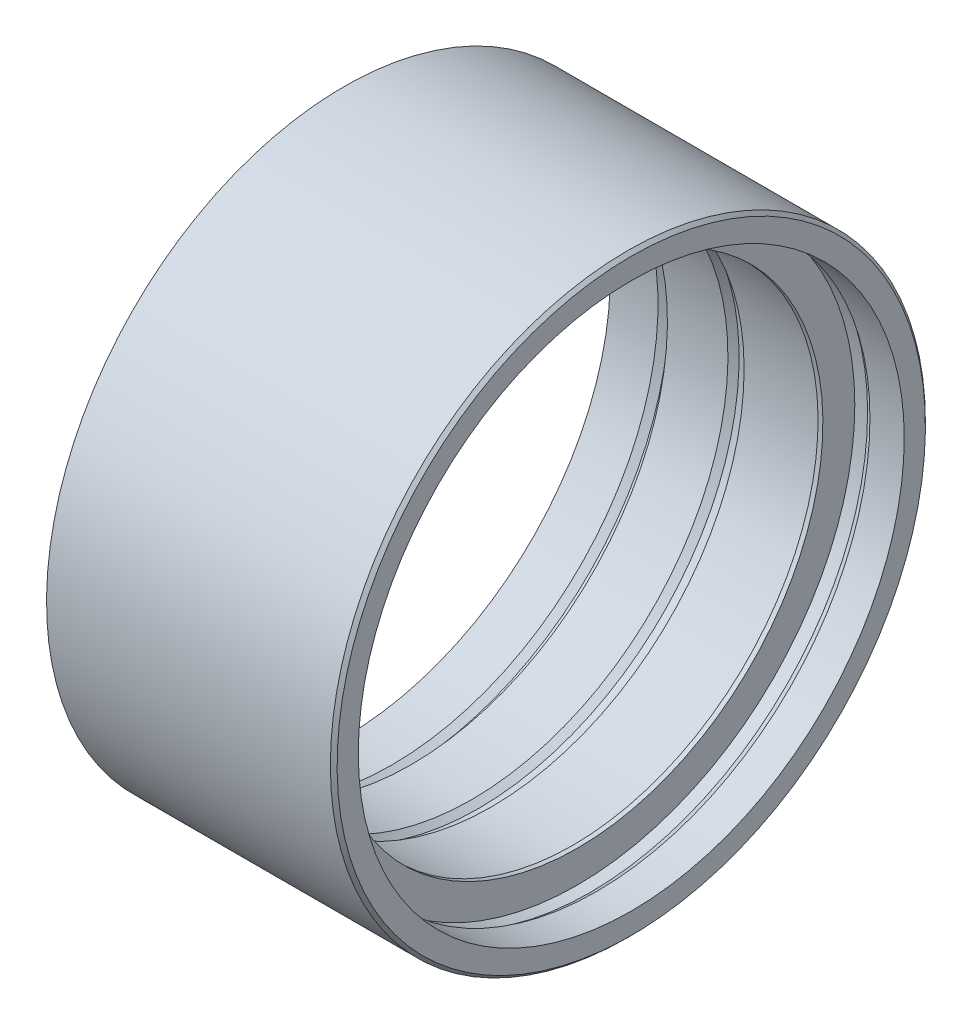
ISO-10303-21;
HEADER;
FILE_DESCRIPTION(('STEP AP214'),'2;1');
FILE_NAME('part.step','',(''),(''),'','','');
FILE_SCHEMA(('AUTOMOTIVE_DESIGN { 1 0 10303 214 1 1 1 1 }'));
ENDSEC;
DATA;
#1=APPLICATION_CONTEXT('core data for automotive mechanical design processes');
#2=APPLICATION_PROTOCOL_DEFINITION('international standard','automotive_design',2000,#1);
#3=PRODUCT_CONTEXT('',#1,'mechanical');
#4=PRODUCT('Part','Part','',(#3));
#5=PRODUCT_RELATED_PRODUCT_CATEGORY('part','',(#4));
#6=PRODUCT_DEFINITION_FORMATION('','',#4);
#7=PRODUCT_DEFINITION_CONTEXT('part definition',#1,'design');
#8=PRODUCT_DEFINITION('design','',#6,#7);
#9=PRODUCT_DEFINITION_SHAPE('','',#8);
#10=(LENGTH_UNIT() NAMED_UNIT(*) SI_UNIT(.MILLI.,.METRE.));
#11=(NAMED_UNIT(*) PLANE_ANGLE_UNIT() SI_UNIT($,.RADIAN.));
#12=(NAMED_UNIT(*) SI_UNIT($,.STERADIAN.) SOLID_ANGLE_UNIT());
#13=UNCERTAINTY_MEASURE_WITH_UNIT(LENGTH_MEASURE(1.E-05),#10,'distance_accuracy_value','');
#14=(GEOMETRIC_REPRESENTATION_CONTEXT(3) GLOBAL_UNCERTAINTY_ASSIGNED_CONTEXT((#13)) GLOBAL_UNIT_ASSIGNED_CONTEXT((#10,
#11,#12)) REPRESENTATION_CONTEXT('',''));
#15=CARTESIAN_POINT('',(0.,0.,0.));
#16=DIRECTION('',(0.,0.,1.));
#17=DIRECTION('',(1.,0.,0.));
#18=AXIS2_PLACEMENT_3D('',#15,#16,#17);
#19=CARTESIAN_POINT('',(6.00000000000056,-44.2500000000002,0.));
#20=DIRECTION('',(1.00000000000002,0.,0.));
#21=DIRECTION('',(0.,1.00000000000004,0.));
#22=AXIS2_PLACEMENT_3D('',#19,#20,#21);
#23=PLANE('',#22);
#24=CARTESIAN_POINT('',(6.00000000000006,-1.11022302462516E-13,-1.2630913280694E-13));
#25=DIRECTION('',(1.00000000000002,0.,0.));
#26=DIRECTION('',(0.,1.00000000000004,0.));
#27=AXIS2_PLACEMENT_3D('',#24,#25,#26);
#28=CIRCLE('',#27,43.75);
#29=CARTESIAN_POINT('',(5.99999999999911,43.7500000000015,0.));
#30=VERTEX_POINT('',#29);
#31=EDGE_CURVE('E12',#30,#30,#28,.T.);
#32=ORIENTED_EDGE('',*,*,#31,.T.);
#33=EDGE_LOOP('',(#32));
#34=FACE_BOUND('',#33,.T.);
#35=CARTESIAN_POINT('',(6.00000000000006,-1.11022302462516E-13,-1.2630913280694E-13));
#36=DIRECTION('',(-1.00000000000002,0.,0.));
#37=DIRECTION('',(0.,-1.00000000000004,0.));
#38=AXIS2_PLACEMENT_3D('',#35,#36,#37);
#39=CIRCLE('',#38,40.6);
#40=CARTESIAN_POINT('',(6.00000000000095,-40.6000000000016,-1.66745847861195E-13));
#41=VERTEX_POINT('',#40);
#42=EDGE_CURVE('E64',#41,#41,#39,.T.);
#43=ORIENTED_EDGE('',*,*,#42,.T.);
#44=EDGE_LOOP('',(#43));
#45=FACE_BOUND('',#44,.T.);
#46=ADVANCED_FACE('F53',(#34,#45),#23,.T.);
#47=CARTESIAN_POINT('',(0.,0.,0.));
#48=DIRECTION('',(-1.00000000000002,0.,0.));
#49=DIRECTION('',(0.,-1.00000000000004,0.));
#50=AXIS2_PLACEMENT_3D('',#47,#48,#49);
#51=CYLINDRICAL_SURFACE('',#50,40.6);
#52=CARTESIAN_POINT('',(0.899999999999956,0.,0.));
#53=DIRECTION('',(-1.00000000000002,0.,0.));
#54=DIRECTION('',(0.,-1.00000000000004,0.));
#55=AXIS2_PLACEMENT_3D('',#52,#53,#54);
#56=CIRCLE('',#55,40.6);
#57=CARTESIAN_POINT('',(0.90000000000084,-40.6000000000016,0.));
#58=VERTEX_POINT('',#57);
#59=EDGE_CURVE('E68',#58,#58,#56,.T.);
#60=ORIENTED_EDGE('',*,*,#59,.T.);
#61=EDGE_LOOP('',(#60));
#62=FACE_BOUND('',#61,.T.);
#63=ORIENTED_EDGE('',*,*,#42,.F.);
#64=EDGE_LOOP('',(#63));
#65=FACE_BOUND('',#64,.T.);
#66=ADVANCED_FACE('F133',(#62,#65),#51,.F.);
#67=CARTESIAN_POINT('',(0.899999999999956,0.,0.));
#68=DIRECTION('',(-1.00000000000002,0.,0.));
#69=DIRECTION('',(0.,-1.00000000000004,0.));
#70=AXIS2_PLACEMENT_3D('',#67,#68,#69);
#71=CONICAL_SURFACE('',#70,40.6,0.576375220591183);
#72=CARTESIAN_POINT('',(-0.0999999999999335,0.,0.));
#73=DIRECTION('',(-1.00000000000002,0.,0.));
#74=DIRECTION('',(0.,-1.00000000000004,0.));
#75=AXIS2_PLACEMENT_3D('',#72,#73,#74);
#76=CIRCLE('',#75,41.25);
#77=CARTESIAN_POINT('',(-0.0999999999990359,-41.2500000000016,0.));
#78=VERTEX_POINT('',#77);
#79=EDGE_CURVE('E73',#78,#78,#76,.T.);
#80=ORIENTED_EDGE('',*,*,#79,.T.);
#81=EDGE_LOOP('',(#80));
#82=FACE_BOUND('',#81,.T.);
#83=ORIENTED_EDGE('',*,*,#59,.F.);
#84=EDGE_LOOP('',(#83));
#85=FACE_BOUND('',#84,.T.);
#86=ADVANCED_FACE('F137',(#82,#85),#71,.F.);
#87=CARTESIAN_POINT('',(0.,0.,0.));
#88=DIRECTION('',(-1.00000000000002,0.,0.));
#89=DIRECTION('',(0.,-1.00000000000004,0.));
#90=AXIS2_PLACEMENT_3D('',#87,#88,#89);
#91=CYLINDRICAL_SURFACE('',#90,41.25);
#92=CARTESIAN_POINT('',(-1.99999999999995,0.,0.));
#93=DIRECTION('',(-1.00000000000002,0.,0.));
#94=DIRECTION('',(0.,-1.00000000000004,0.));
#95=AXIS2_PLACEMENT_3D('',#92,#93,#94);
#96=CIRCLE('',#95,41.25);
#97=CARTESIAN_POINT('',(-1.99999999999905,-41.2500000000016,0.));
#98=VERTEX_POINT('',#97);
#99=EDGE_CURVE('E76',#98,#98,#96,.T.);
#100=ORIENTED_EDGE('',*,*,#99,.T.);
#101=EDGE_LOOP('',(#100));
#102=FACE_BOUND('',#101,.T.);
#103=ORIENTED_EDGE('',*,*,#79,.F.);
#104=EDGE_LOOP('',(#103));
#105=FACE_BOUND('',#104,.T.);
#106=ADVANCED_FACE('F144',(#102,#105),#91,.F.);
#107=CARTESIAN_POINT('',(-2.,-36.5,0.));
#108=DIRECTION('',(1.00000000000002,0.,0.));
#109=DIRECTION('',(0.,1.00000000000004,0.));
#110=AXIS2_PLACEMENT_3D('',#107,#108,#109);
#111=PLANE('',#110);
#112=CARTESIAN_POINT('',(-1.99999999999995,0.,0.));
#113=DIRECTION('',(-1.00000000000002,0.,0.));
#114=DIRECTION('',(0.,-1.00000000000004,0.));
#115=AXIS2_PLACEMENT_3D('',#112,#113,#114);
#116=CIRCLE('',#115,36.5);
#117=CARTESIAN_POINT('',(-1.99999999999915,-36.5000000000014,0.));
#118=VERTEX_POINT('',#117);
#119=EDGE_CURVE('E79',#118,#118,#116,.T.);
#120=ORIENTED_EDGE('',*,*,#119,.T.);
#121=EDGE_LOOP('',(#120));
#122=FACE_BOUND('',#121,.T.);
#123=ORIENTED_EDGE('',*,*,#99,.F.);
#124=EDGE_LOOP('',(#123));
#125=FACE_BOUND('',#124,.T.);
#126=ADVANCED_FACE('F148',(#122,#125),#111,.T.);
#127=CARTESIAN_POINT('',(0.,0.,0.));
#128=DIRECTION('',(-1.00000000000002,0.,0.));
#129=DIRECTION('',(0.,-1.00000000000004,0.));
#130=AXIS2_PLACEMENT_3D('',#127,#128,#129);
#131=CYLINDRICAL_SURFACE('',#130,36.5);
#132=CARTESIAN_POINT('',(-2.71667511527912,0.,0.));
#133=DIRECTION('',(-1.00000000000002,0.,0.));
#134=DIRECTION('',(0.,-1.00000000000004,0.));
#135=AXIS2_PLACEMENT_3D('',#132,#133,#134);
#136=CIRCLE('',#135,36.5);
#137=CARTESIAN_POINT('',(-2.71667511527833,-36.5000000000014,0.));
#138=VERTEX_POINT('',#137);
#139=EDGE_CURVE('E82',#138,#138,#136,.T.);
#140=ORIENTED_EDGE('',*,*,#139,.T.);
#141=EDGE_LOOP('',(#140));
#142=FACE_BOUND('',#141,.T.);
#143=ORIENTED_EDGE('',*,*,#119,.F.);
#144=EDGE_LOOP('',(#143));
#145=FACE_BOUND('',#144,.T.);
#146=ADVANCED_FACE('F152',(#142,#145),#131,.F.);
#147=CARTESIAN_POINT('',(-2.71667511527912,0.,0.));
#148=DIRECTION('',(-1.00000000000002,0.,0.));
#149=DIRECTION('',(0.,-1.00000000000004,0.));
#150=AXIS2_PLACEMENT_3D('',#147,#148,#149);
#151=CONICAL_SURFACE('',#150,36.5,1.41992030538991);
#152=CARTESIAN_POINT('',(-2.8839096216326,0.,0.));
#153=DIRECTION('',(-1.00000000000002,0.,0.));
#154=DIRECTION('',(0.,-1.00000000000004,0.));
#155=AXIS2_PLACEMENT_3D('',#152,#153,#154);
#156=CIRCLE('',#155,37.6000000080923);
#157=CARTESIAN_POINT('',(-2.88390962163178,-37.6000000080937,0.));
#158=VERTEX_POINT('',#157);
#159=EDGE_CURVE('E85',#158,#158,#156,.T.);
#160=ORIENTED_EDGE('',*,*,#159,.T.);
#161=EDGE_LOOP('',(#160));
#162=FACE_BOUND('',#161,.T.);
#163=ORIENTED_EDGE('',*,*,#139,.F.);
#164=EDGE_LOOP('',(#163));
#165=FACE_BOUND('',#164,.T.);
#166=ADVANCED_FACE('F156',(#162,#165),#151,.F.);
#167=CARTESIAN_POINT('',(0.,0.,0.));
#168=DIRECTION('',(-1.00000000000002,0.,0.));
#169=DIRECTION('',(0.,-1.00000000000004,0.));
#170=AXIS2_PLACEMENT_3D('',#167,#168,#169);
#171=CYLINDRICAL_SURFACE('',#170,37.6000000080923);
#172=CARTESIAN_POINT('',(-14.8133409365376,2.77555756156289E-13,-4.26732650794096E-13));
#173=DIRECTION('',(-1.00000000000002,0.,0.));
#174=DIRECTION('',(0.,-1.00000000000004,0.));
#175=AXIS2_PLACEMENT_3D('',#172,#173,#174);
#176=CIRCLE('',#175,37.6000000080923);
#177=CARTESIAN_POINT('',(-14.8133409365368,-37.6000000080935,-4.64181431246491E-13));
#178=VERTEX_POINT('',#177);
#179=EDGE_CURVE('E88',#178,#178,#176,.T.);
#180=ORIENTED_EDGE('',*,*,#179,.T.);
#181=EDGE_LOOP('',(#180));
#182=FACE_BOUND('',#181,.T.);
#183=ORIENTED_EDGE('',*,*,#159,.F.);
#184=EDGE_LOOP('',(#183));
#185=FACE_BOUND('',#184,.T.);
#186=ADVANCED_FACE('F160',(#182,#185),#171,.F.);
#187=CARTESIAN_POINT('',(-14.8133409365368,-37.6000000080924,-2.25383560871781E-13));
#188=DIRECTION('',(-1.00000000000002,0.,0.));
#189=DIRECTION('',(0.,-1.00000000000004,0.));
#190=AXIS2_PLACEMENT_3D('',#187,#188,#189);
#191=PLANE('',#190);
#192=CARTESIAN_POINT('',(-14.8133409365376,2.77555756156289E-13,-4.26732650794096E-13));
#193=DIRECTION('',(-1.00000000000002,0.,0.));
#194=DIRECTION('',(0.,-1.00000000000004,0.));
#195=AXIS2_PLACEMENT_3D('',#192,#193,#194);
#196=CIRCLE('',#195,38.75);
#197=CARTESIAN_POINT('',(-14.8133409365368,-38.7500000000012,-4.65326806172234E-13));
#198=VERTEX_POINT('',#197);
#199=EDGE_CURVE('E91',#198,#198,#196,.T.);
#200=ORIENTED_EDGE('',*,*,#199,.T.);
#201=EDGE_LOOP('',(#200));
#202=FACE_BOUND('',#201,.T.);
#203=ORIENTED_EDGE('',*,*,#179,.F.);
#204=EDGE_LOOP('',(#203));
#205=FACE_BOUND('',#204,.T.);
#206=ADVANCED_FACE('F164',(#202,#205),#191,.T.);
#207=CARTESIAN_POINT('',(0.,0.,0.));
#208=DIRECTION('',(-1.00000000000002,0.,0.));
#209=DIRECTION('',(0.,-1.00000000000004,0.));
#210=AXIS2_PLACEMENT_3D('',#207,#208,#209);
#211=CYLINDRICAL_SURFACE('',#210,38.75);
#212=CARTESIAN_POINT('',(-16.7133409365369,0.,0.));
#213=DIRECTION('',(-1.00000000000002,0.,0.));
#214=DIRECTION('',(0.,-1.00000000000004,0.));
#215=AXIS2_PLACEMENT_3D('',#212,#213,#214);
#216=CIRCLE('',#215,38.75);
#217=CARTESIAN_POINT('',(-16.713340936536,-38.7500000000014,0.));
#218=VERTEX_POINT('',#217);
#219=EDGE_CURVE('E94',#218,#218,#216,.T.);
#220=ORIENTED_EDGE('',*,*,#219,.T.);
#221=EDGE_LOOP('',(#220));
#222=FACE_BOUND('',#221,.T.);
#223=ORIENTED_EDGE('',*,*,#199,.F.);
#224=EDGE_LOOP('',(#223));
#225=FACE_BOUND('',#224,.T.);
#226=ADVANCED_FACE('F168',(#222,#225),#211,.F.);
#227=CARTESIAN_POINT('',(-16.7133409365369,0.,0.));
#228=DIRECTION('',(1.00000000000002,0.,0.));
#229=DIRECTION('',(0.,1.00000000000004,0.));
#230=AXIS2_PLACEMENT_3D('',#227,#228,#229);
#231=CONICAL_SURFACE('',#230,38.75,0.580581589500935);
#232=CARTESIAN_POINT('',(-17.7133409365371,2.08166817117217E-13,-2.87273735489924E-13));
#233=DIRECTION('',(-1.00000000000002,0.,0.));
#234=DIRECTION('',(0.,-1.00000000000004,0.));
#235=AXIS2_PLACEMENT_3D('',#232,#233,#234);
#236=CIRCLE('',#235,38.094);
#237=CARTESIAN_POINT('',(-17.7133409365363,-38.0940000000013,-3.25214529166692E-13));
#238=VERTEX_POINT('',#237);
#239=EDGE_CURVE('E97',#238,#238,#236,.T.);
#240=ORIENTED_EDGE('',*,*,#239,.T.);
#241=EDGE_LOOP('',(#240));
#242=FACE_BOUND('',#241,.T.);
#243=ORIENTED_EDGE('',*,*,#219,.F.);
#244=EDGE_LOOP('',(#243));
#245=FACE_BOUND('',#244,.T.);
#246=ADVANCED_FACE('F172',(#242,#245),#231,.F.);
#247=CARTESIAN_POINT('',(0.,0.,0.));
#248=DIRECTION('',(-1.00000000000002,0.,0.));
#249=DIRECTION('',(0.,-1.00000000000004,0.));
#250=AXIS2_PLACEMENT_3D('',#247,#248,#249);
#251=CYLINDRICAL_SURFACE('',#250,38.094);
#252=CARTESIAN_POINT('',(-26.7133409365368,1.52655665885959E-13,0.));
#253=DIRECTION('',(-1.00000000000002,0.,0.));
#254=DIRECTION('',(0.,-1.00000000000004,0.));
#255=AXIS2_PLACEMENT_3D('',#252,#253,#254);
#256=CIRCLE('',#255,38.0940000000001);
#257=CARTESIAN_POINT('',(-26.713340936536,-38.0940000000013,0.));
#258=VERTEX_POINT('',#257);
#259=EDGE_CURVE('E100',#258,#258,#256,.T.);
#260=ORIENTED_EDGE('',*,*,#259,.T.);
#261=EDGE_LOOP('',(#260));
#262=FACE_BOUND('',#261,.T.);
#263=ORIENTED_EDGE('',*,*,#239,.F.);
#264=EDGE_LOOP('',(#263));
#265=FACE_BOUND('',#264,.T.);
#266=ADVANCED_FACE('F176',(#262,#265),#251,.F.);
#267=CARTESIAN_POINT('',(-26.7133409365366,-38.0939999999999,0.));
#268=DIRECTION('',(-1.00000000000002,0.,0.));
#269=DIRECTION('',(0.,-1.00000000000004,0.));
#270=AXIS2_PLACEMENT_3D('',#267,#268,#269);
#271=PLANE('',#270);
#272=CARTESIAN_POINT('',(-26.7133409365368,1.52655665885959E-13,0.));
#273=DIRECTION('',(-1.00000000000002,0.,0.));
#274=DIRECTION('',(0.,-1.00000000000004,0.));
#275=AXIS2_PLACEMENT_3D('',#272,#273,#274);
#276=CIRCLE('',#275,40.25);
#277=CARTESIAN_POINT('',(-26.7133409365359,-40.2500000000014,0.));
#278=VERTEX_POINT('',#277);
#279=EDGE_CURVE('E103',#278,#278,#276,.T.);
#280=ORIENTED_EDGE('',*,*,#279,.T.);
#281=EDGE_LOOP('',(#280));
#282=FACE_BOUND('',#281,.T.);
#283=ORIENTED_EDGE('',*,*,#259,.F.);
#284=EDGE_LOOP('',(#283));
#285=FACE_BOUND('',#284,.T.);
#286=ADVANCED_FACE('F180',(#282,#285),#271,.T.);
#287=CARTESIAN_POINT('',(0.,0.,0.));
#288=DIRECTION('',(-1.00000000000002,0.,0.));
#289=DIRECTION('',(0.,-1.00000000000004,0.));
#290=AXIS2_PLACEMENT_3D('',#287,#288,#289);
#291=CYLINDRICAL_SURFACE('',#290,40.25);
#292=CARTESIAN_POINT('',(-28.6133409365374,4.02455846426619E-13,-2.01447248034858E-13));
#293=DIRECTION('',(-1.00000000000002,0.,0.));
#294=DIRECTION('',(0.,-1.00000000000004,0.));
#295=AXIS2_PLACEMENT_3D('',#292,#293,#294);
#296=CIRCLE('',#295,40.25);
#297=CARTESIAN_POINT('',(-28.6133409365365,-40.2500000000012,-2.41535370717956E-13));
#298=VERTEX_POINT('',#297);
#299=EDGE_CURVE('E106',#298,#298,#296,.T.);
#300=ORIENTED_EDGE('',*,*,#299,.T.);
#301=EDGE_LOOP('',(#300));
#302=FACE_BOUND('',#301,.T.);
#303=ORIENTED_EDGE('',*,*,#279,.F.);
#304=EDGE_LOOP('',(#303));
#305=FACE_BOUND('',#304,.T.);
#306=ADVANCED_FACE('F184',(#302,#305),#291,.F.);
#307=CARTESIAN_POINT('',(-28.6133409365374,4.02455846426619E-13,-2.01447248034858E-13));
#308=DIRECTION('',(1.00000000000002,0.,0.));
#309=DIRECTION('',(0.,1.00000000000004,0.));
#310=AXIS2_PLACEMENT_3D('',#307,#308,#309);
#311=CONICAL_SURFACE('',#310,40.25,0.580581589500935);
#312=CARTESIAN_POINT('',(-29.613340936537,0.,0.));
#313=DIRECTION('',(-1.00000000000002,0.,0.));
#314=DIRECTION('',(0.,-1.00000000000004,0.));
#315=AXIS2_PLACEMENT_3D('',#312,#313,#314);
#316=CIRCLE('',#315,39.5940000000001);
#317=CARTESIAN_POINT('',(-29.6133409365361,-39.5940000000015,0.));
#318=VERTEX_POINT('',#317);
#319=EDGE_CURVE('E109',#318,#318,#316,.T.);
#320=ORIENTED_EDGE('',*,*,#319,.T.);
#321=EDGE_LOOP('',(#320));
#322=FACE_BOUND('',#321,.T.);
#323=ORIENTED_EDGE('',*,*,#299,.F.);
#324=EDGE_LOOP('',(#323));
#325=FACE_BOUND('',#324,.T.);
#326=ADVANCED_FACE('F188',(#322,#325),#311,.F.);
#327=CARTESIAN_POINT('',(0.,0.,0.));
#328=DIRECTION('',(-1.00000000000002,0.,0.));
#329=DIRECTION('',(0.,-1.00000000000004,0.));
#330=AXIS2_PLACEMENT_3D('',#327,#328,#329);
#331=CYLINDRICAL_SURFACE('',#330,39.5940000000001);
#332=CARTESIAN_POINT('',(-36.7133409365376,3.7470027081099E-13,-2.68933979649505E-13));
#333=DIRECTION('',(-1.00000000000002,0.,0.));
#334=DIRECTION('',(0.,-1.00000000000004,0.));
#335=AXIS2_PLACEMENT_3D('',#332,#333,#334);
#336=CIRCLE('',#335,39.5940000000001);
#337=CARTESIAN_POINT('',(-36.7133409365367,-39.5940000000012,-3.08368740631233E-13));
#338=VERTEX_POINT('',#337);
#339=EDGE_CURVE('E112',#338,#338,#336,.T.);
#340=ORIENTED_EDGE('',*,*,#339,.T.);
#341=EDGE_LOOP('',(#340));
#342=FACE_BOUND('',#341,.T.);
#343=ORIENTED_EDGE('',*,*,#319,.F.);
#344=EDGE_LOOP('',(#343));
#345=FACE_BOUND('',#344,.T.);
#346=ADVANCED_FACE('F130',(#342,#345),#331,.F.);
#347=CARTESIAN_POINT('',(-36.7133409365371,-39.594,0.));
#348=DIRECTION('',(-1.00000000000002,0.,0.));
#349=DIRECTION('',(0.,-1.00000000000004,0.));
#350=AXIS2_PLACEMENT_3D('',#347,#348,#349);
#351=PLANE('',#350);
#352=CARTESIAN_POINT('',(-36.7133409365376,3.7470027081099E-13,-2.68933979649505E-13));
#353=DIRECTION('',(-1.00000000000002,0.,0.));
#354=DIRECTION('',(0.,-1.00000000000004,0.));
#355=AXIS2_PLACEMENT_3D('',#352,#353,#354);
#356=CIRCLE('',#355,44.2500000000001);
#357=CARTESIAN_POINT('',(-36.7133409365366,-44.2500000000014,-3.1300601514583E-13));
#358=VERTEX_POINT('',#357);
#359=EDGE_CURVE('E115',#358,#358,#356,.T.);
#360=ORIENTED_EDGE('',*,*,#359,.T.);
#361=EDGE_LOOP('',(#360));
#362=FACE_BOUND('',#361,.T.);
#363=ORIENTED_EDGE('',*,*,#339,.F.);
#364=EDGE_LOOP('',(#363));
#365=FACE_BOUND('',#364,.T.);
#366=ADVANCED_FACE('F119',(#362,#365),#351,.T.);
#367=CARTESIAN_POINT('',(0.,0.,0.));
#368=DIRECTION('',(-1.00000000000002,0.,0.));
#369=DIRECTION('',(0.,-1.00000000000004,0.));
#370=AXIS2_PLACEMENT_3D('',#367,#368,#369);
#371=CYLINDRICAL_SURFACE('',#370,44.25);
#372=CARTESIAN_POINT('',(5.50000000000001,0.,0.));
#373=DIRECTION('',(1.00000000000002,0.,0.));
#374=DIRECTION('',(0.,1.00000000000004,0.));
#375=AXIS2_PLACEMENT_3D('',#372,#373,#374);
#376=CIRCLE('',#375,44.25);
#377=CARTESIAN_POINT('',(5.49999999999904,44.2500000000017,0.));
#378=VERTEX_POINT('',#377);
#379=EDGE_CURVE('E60',#378,#378,#376,.F.);
#380=ORIENTED_EDGE('',*,*,#379,.T.);
#381=EDGE_LOOP('',(#380));
#382=FACE_BOUND('',#381,.T.);
#383=ORIENTED_EDGE('',*,*,#359,.F.);
#384=EDGE_LOOP('',(#383));
#385=FACE_BOUND('',#384,.T.);
#386=ADVANCED_FACE('F122',(#382,#385),#371,.T.);
#387=CARTESIAN_POINT('',(5.50000000000001,0.,0.));
#388=DIRECTION('',(-1.00000000000002,0.,0.));
#389=DIRECTION('',(0.,-1.00000000000004,0.));
#390=AXIS2_PLACEMENT_3D('',#387,#388,#389);
#391=CONICAL_SURFACE('',#390,44.25,0.78539816339744);
#392=ORIENTED_EDGE('',*,*,#31,.F.);
#393=EDGE_LOOP('',(#392));
#394=FACE_BOUND('',#393,.T.);
#395=ORIENTED_EDGE('',*,*,#379,.F.);
#396=EDGE_LOOP('',(#395));
#397=FACE_BOUND('',#396,.T.);
#398=ADVANCED_FACE('F55',(#394,#397),#391,.T.);
#399=CLOSED_SHELL('',(#46,#66,#86,#106,#126,#146,#166,#186,#206,#226,#246,#266,#286,#306,#326,
#346,#366,#386,#398));
#400=MANIFOLD_SOLID_BREP('B2',#399);
#401=ADVANCED_BREP_SHAPE_REPRESENTATION('',(#18,#400),#14);
#402=SHAPE_DEFINITION_REPRESENTATION(#9,#401);
ENDSEC;
END-ISO-10303-21;
